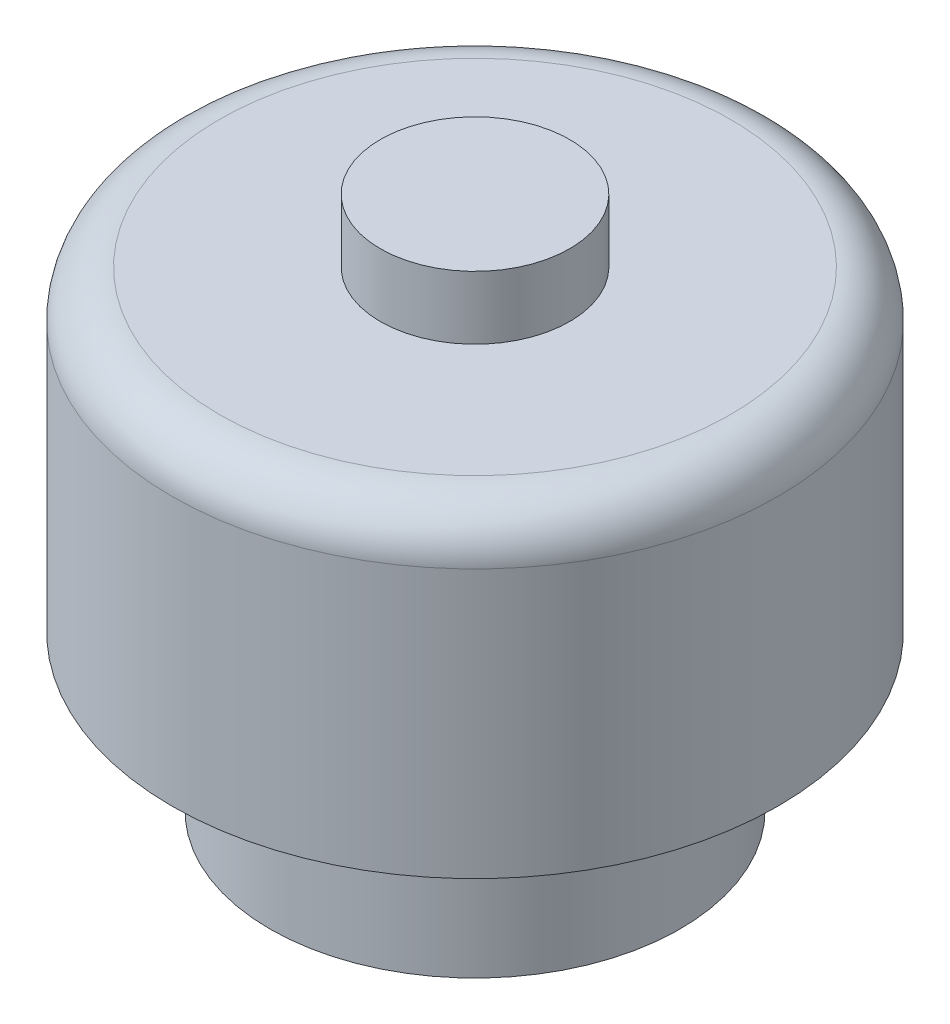
ISO-10303-21;
HEADER;
FILE_DESCRIPTION(('STEP AP214'),'2;1');
FILE_NAME('part.step','',(''),(''),'','','');
FILE_SCHEMA(('AUTOMOTIVE_DESIGN { 1 0 10303 214 1 1 1 1 }'));
ENDSEC;
DATA;
#1=APPLICATION_CONTEXT('core data for automotive mechanical design processes');
#2=APPLICATION_PROTOCOL_DEFINITION('international standard','automotive_design',2000,#1);
#3=PRODUCT_CONTEXT('',#1,'mechanical');
#4=PRODUCT('Part','Part','',(#3));
#5=PRODUCT_RELATED_PRODUCT_CATEGORY('part','',(#4));
#6=PRODUCT_DEFINITION_FORMATION('','',#4);
#7=PRODUCT_DEFINITION_CONTEXT('part definition',#1,'design');
#8=PRODUCT_DEFINITION('design','',#6,#7);
#9=PRODUCT_DEFINITION_SHAPE('','',#8);
#10=(LENGTH_UNIT() NAMED_UNIT(*) SI_UNIT(.MILLI.,.METRE.));
#11=(NAMED_UNIT(*) PLANE_ANGLE_UNIT() SI_UNIT($,.RADIAN.));
#12=(NAMED_UNIT(*) SI_UNIT($,.STERADIAN.) SOLID_ANGLE_UNIT());
#13=UNCERTAINTY_MEASURE_WITH_UNIT(LENGTH_MEASURE(1.E-05),#10,'distance_accuracy_value','');
#14=(GEOMETRIC_REPRESENTATION_CONTEXT(3) GLOBAL_UNCERTAINTY_ASSIGNED_CONTEXT((#13)) GLOBAL_UNIT_ASSIGNED_CONTEXT((#10,
#11,#12)) REPRESENTATION_CONTEXT('',''));
#15=CARTESIAN_POINT('',(0.,0.,0.));
#16=DIRECTION('',(0.,0.,1.));
#17=DIRECTION('',(1.,0.,0.));
#18=AXIS2_PLACEMENT_3D('',#15,#16,#17);
#19=CARTESIAN_POINT('',(0.,2.46,0.));
#20=DIRECTION('',(0.,-1.,0.));
#21=DIRECTION('',(0.,0.,-1.));
#22=AXIS2_PLACEMENT_3D('',#19,#20,#21);
#23=CYLINDRICAL_SURFACE('',#22,3.25);
#24=CARTESIAN_POINT('',(0.,2.46,0.));
#25=DIRECTION('',(0.,1.,0.));
#26=DIRECTION('',(0.,0.,1.));
#27=AXIS2_PLACEMENT_3D('',#24,#25,#26);
#28=CIRCLE('',#27,3.25);
#29=CARTESIAN_POINT('',(0.,2.46,3.25));
#30=VERTEX_POINT('',#29);
#31=EDGE_CURVE('E93',#30,#30,#28,.T.);
#32=ORIENTED_EDGE('',*,*,#31,.F.);
#33=EDGE_LOOP('',(#32));
#34=FACE_BOUND('',#33,.T.);
#35=CARTESIAN_POINT('',(0.,0.,0.));
#36=DIRECTION('',(0.,1.,0.));
#37=DIRECTION('',(0.,0.,1.));
#38=AXIS2_PLACEMENT_3D('',#35,#36,#37);
#39=CIRCLE('',#38,3.25);
#40=CARTESIAN_POINT('',(0.,0.,3.25));
#41=VERTEX_POINT('',#40);
#42=EDGE_CURVE('E98',#41,#41,#39,.T.);
#43=ORIENTED_EDGE('',*,*,#42,.T.);
#44=EDGE_LOOP('',(#43));
#45=FACE_BOUND('',#44,.T.);
#46=ADVANCED_FACE('F80',(#34,#45),#23,.T.);
#47=CARTESIAN_POINT('',(0.,0.,0.));
#48=DIRECTION('',(0.,1.,0.));
#49=DIRECTION('',(0.,0.,1.));
#50=AXIS2_PLACEMENT_3D('',#47,#48,#49);
#51=PLANE('',#50);
#52=CARTESIAN_POINT('',(0.,0.,0.));
#53=DIRECTION('',(0.,-1.,0.));
#54=DIRECTION('',(0.,0.,-1.));
#55=AXIS2_PLACEMENT_3D('',#52,#53,#54);
#56=CIRCLE('',#55,1.75);
#57=CARTESIAN_POINT('',(0.,0.,-1.75));
#58=VERTEX_POINT('',#57);
#59=EDGE_CURVE('E103',#58,#58,#56,.T.);
#60=ORIENTED_EDGE('',*,*,#59,.F.);
#61=EDGE_LOOP('',(#60));
#62=FACE_BOUND('',#61,.T.);
#63=ORIENTED_EDGE('',*,*,#42,.F.);
#64=EDGE_LOOP('',(#63));
#65=FACE_BOUND('',#64,.T.);
#66=ADVANCED_FACE('F149',(#62,#65),#51,.F.);
#67=CARTESIAN_POINT('',(0.,2.5,0.));
#68=DIRECTION('',(0.,-1.,0.));
#69=DIRECTION('',(0.,0.,-1.));
#70=AXIS2_PLACEMENT_3D('',#67,#68,#69);
#71=CYLINDRICAL_SURFACE('',#70,1.75);
#72=CARTESIAN_POINT('',(0.,2.46,0.));
#73=DIRECTION('',(0.,1.,0.));
#74=DIRECTION('',(0.,0.,1.));
#75=AXIS2_PLACEMENT_3D('',#72,#73,#74);
#76=CIRCLE('',#75,1.75);
#77=CARTESIAN_POINT('',(0.,2.46,1.75));
#78=VERTEX_POINT('',#77);
#79=EDGE_CURVE('E105',#78,#78,#76,.T.);
#80=ORIENTED_EDGE('',*,*,#79,.T.);
#81=EDGE_LOOP('',(#80));
#82=FACE_BOUND('',#81,.T.);
#83=ORIENTED_EDGE('',*,*,#59,.T.);
#84=EDGE_LOOP('',(#83));
#85=FACE_BOUND('',#84,.T.);
#86=ADVANCED_FACE('F145',(#82,#85),#71,.F.);
#87=CARTESIAN_POINT('',(0.,2.46,0.));
#88=DIRECTION('',(0.,1.,0.));
#89=DIRECTION('',(0.,0.,1.));
#90=AXIS2_PLACEMENT_3D('',#87,#88,#89);
#91=PLANE('',#90);
#92=ORIENTED_EDGE('',*,*,#31,.T.);
#93=EDGE_LOOP('',(#92));
#94=FACE_BOUND('',#93,.T.);
#95=CARTESIAN_POINT('',(0.,2.46,0.));
#96=DIRECTION('',(0.,1.,0.));
#97=DIRECTION('',(0.,0.,1.));
#98=AXIS2_PLACEMENT_3D('',#95,#96,#97);
#99=CIRCLE('',#98,4.8);
#100=CARTESIAN_POINT('',(0.,2.46,4.8));
#101=VERTEX_POINT('',#100);
#102=EDGE_CURVE('E109',#101,#101,#99,.T.);
#103=ORIENTED_EDGE('',*,*,#102,.F.);
#104=EDGE_LOOP('',(#103));
#105=FACE_BOUND('',#104,.T.);
#106=ADVANCED_FACE('F136',(#94,#105),#91,.F.);
#107=CARTESIAN_POINT('',(0.,7.46,0.));
#108=DIRECTION('',(0.,1.,0.));
#109=DIRECTION('',(0.,0.,1.));
#110=AXIS2_PLACEMENT_3D('',#107,#108,#109);
#111=PLANE('',#110);
#112=CARTESIAN_POINT('',(0.,7.46,0.));
#113=DIRECTION('',(0.,1.,0.));
#114=DIRECTION('',(0.,0.,1.));
#115=AXIS2_PLACEMENT_3D('',#112,#113,#114);
#116=CIRCLE('',#115,1.5);
#117=CARTESIAN_POINT('',(0.,7.46,1.5));
#118=VERTEX_POINT('',#117);
#119=EDGE_CURVE('E117',#118,#118,#116,.T.);
#120=ORIENTED_EDGE('',*,*,#119,.F.);
#121=EDGE_LOOP('',(#120));
#122=FACE_BOUND('',#121,.T.);
#123=CARTESIAN_POINT('',(0.,7.46,0.));
#124=DIRECTION('',(0.,1.,0.));
#125=DIRECTION('',(0.,0.,1.));
#126=AXIS2_PLACEMENT_3D('',#123,#124,#125);
#127=CIRCLE('',#126,4.05);
#128=CARTESIAN_POINT('',(0.,7.46,4.05));
#129=VERTEX_POINT('',#128);
#130=EDGE_CURVE('E88',#129,#129,#127,.T.);
#131=ORIENTED_EDGE('',*,*,#130,.T.);
#132=EDGE_LOOP('',(#131));
#133=FACE_BOUND('',#132,.T.);
#134=ADVANCED_FACE('F133',(#122,#133),#111,.T.);
#135=CARTESIAN_POINT('',(0.,7.46,0.));
#136=DIRECTION('',(0.,-1.,0.));
#137=DIRECTION('',(0.,0.,-1.));
#138=AXIS2_PLACEMENT_3D('',#135,#136,#137);
#139=CYLINDRICAL_SURFACE('',#138,4.8);
#140=CARTESIAN_POINT('',(0.,6.71,0.));
#141=DIRECTION('',(0.,1.,0.));
#142=DIRECTION('',(0.,0.,1.));
#143=AXIS2_PLACEMENT_3D('',#140,#141,#142);
#144=CIRCLE('',#143,4.8);
#145=CARTESIAN_POINT('',(0.,6.71,4.8));
#146=VERTEX_POINT('',#145);
#147=EDGE_CURVE('E11',#146,#146,#144,.F.);
#148=ORIENTED_EDGE('',*,*,#147,.T.);
#149=EDGE_LOOP('',(#148));
#150=FACE_BOUND('',#149,.T.);
#151=ORIENTED_EDGE('',*,*,#102,.T.);
#152=EDGE_LOOP('',(#151));
#153=FACE_BOUND('',#152,.T.);
#154=ADVANCED_FACE('F135',(#150,#153),#139,.T.);
#155=ORIENTED_EDGE('',*,*,#79,.F.);
#156=EDGE_LOOP('',(#155));
#157=FACE_BOUND('',#156,.T.);
#158=ADVANCED_FACE('F142',(#157),#91,.F.);
#159=CARTESIAN_POINT('',(0.,6.71,0.));
#160=DIRECTION('',(0.,1.,0.));
#161=DIRECTION('',(0.,0.,1.));
#162=AXIS2_PLACEMENT_3D('',#159,#160,#161);
#163=TOROIDAL_SURFACE('',#162,4.05,0.75);
#164=ORIENTED_EDGE('',*,*,#147,.F.);
#165=EDGE_LOOP('',(#164));
#166=FACE_BOUND('',#165,.T.);
#167=ORIENTED_EDGE('',*,*,#130,.F.);
#168=EDGE_LOOP('',(#167));
#169=FACE_BOUND('',#168,.T.);
#170=ADVANCED_FACE('F82',(#166,#169),#163,.T.);
#171=CARTESIAN_POINT('',(0.,8.46,0.));
#172=DIRECTION('',(0.,-1.,0.));
#173=DIRECTION('',(0.,0.,-1.));
#174=AXIS2_PLACEMENT_3D('',#171,#172,#173);
#175=CYLINDRICAL_SURFACE('',#174,1.5);
#176=CARTESIAN_POINT('',(0.,8.46,0.));
#177=DIRECTION('',(0.,1.,0.));
#178=DIRECTION('',(0.,0.,1.));
#179=AXIS2_PLACEMENT_3D('',#176,#177,#178);
#180=CIRCLE('',#179,1.5);
#181=CARTESIAN_POINT('',(0.,8.46,1.5));
#182=VERTEX_POINT('',#181);
#183=EDGE_CURVE('E116',#182,#182,#180,.T.);
#184=ORIENTED_EDGE('',*,*,#183,.F.);
#185=EDGE_LOOP('',(#184));
#186=FACE_BOUND('',#185,.T.);
#187=ORIENTED_EDGE('',*,*,#119,.T.);
#188=EDGE_LOOP('',(#187));
#189=FACE_BOUND('',#188,.T.);
#190=ADVANCED_FACE('F127',(#186,#189),#175,.T.);
#191=CARTESIAN_POINT('',(0.,8.46,0.));
#192=DIRECTION('',(0.,1.,0.));
#193=DIRECTION('',(0.,0.,1.));
#194=AXIS2_PLACEMENT_3D('',#191,#192,#193);
#195=PLANE('',#194);
#196=ORIENTED_EDGE('',*,*,#183,.T.);
#197=EDGE_LOOP('',(#196));
#198=FACE_BOUND('',#197,.T.);
#199=ADVANCED_FACE('F125',(#198),#195,.T.);
#200=CLOSED_SHELL('',(#46,#66,#86,#106,#134,#154,#158,#170,#190,#199));
#201=MANIFOLD_SOLID_BREP('B2',#200);
#202=ADVANCED_BREP_SHAPE_REPRESENTATION('',(#18,#201),#14);
#203=SHAPE_DEFINITION_REPRESENTATION(#9,#202);
ENDSEC;
END-ISO-10303-21;
